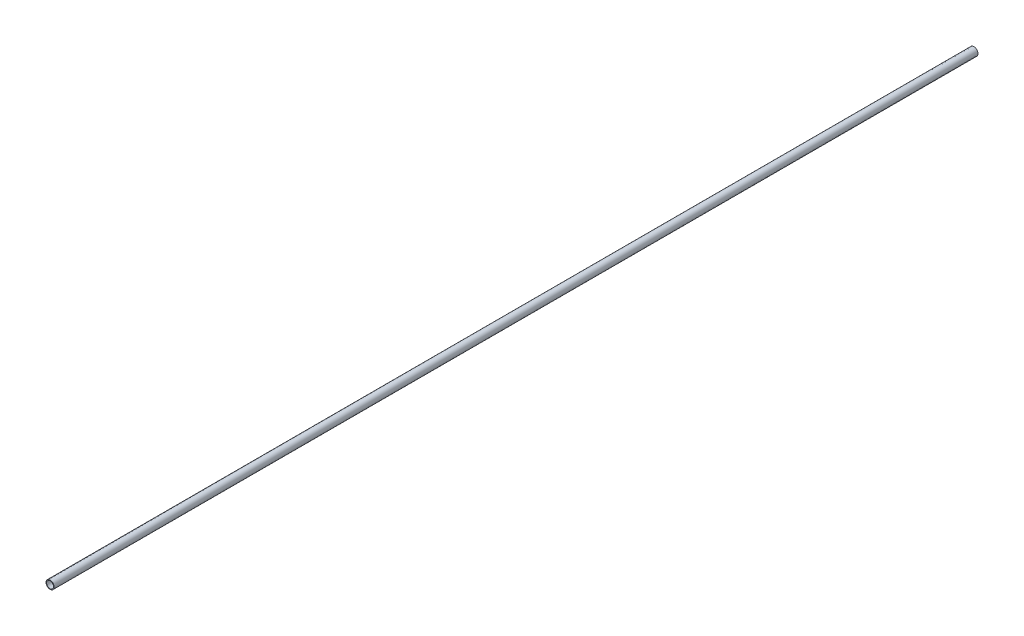
ISO-10303-21;
HEADER;
FILE_DESCRIPTION(('STEP AP214'),'2;1');
FILE_NAME('part.step','',(''),(''),'','','');
FILE_SCHEMA(('AUTOMOTIVE_DESIGN { 1 0 10303 214 1 1 1 1 }'));
ENDSEC;
DATA;
#1=APPLICATION_CONTEXT('core data for automotive mechanical design processes');
#2=APPLICATION_PROTOCOL_DEFINITION('international standard','automotive_design',2000,#1);
#3=PRODUCT_CONTEXT('',#1,'mechanical');
#4=PRODUCT('Part','Part','',(#3));
#5=PRODUCT_RELATED_PRODUCT_CATEGORY('part','',(#4));
#6=PRODUCT_DEFINITION_FORMATION('','',#4);
#7=PRODUCT_DEFINITION_CONTEXT('part definition',#1,'design');
#8=PRODUCT_DEFINITION('design','',#6,#7);
#9=PRODUCT_DEFINITION_SHAPE('','',#8);
#10=(LENGTH_UNIT() NAMED_UNIT(*) SI_UNIT(.MILLI.,.METRE.));
#11=(NAMED_UNIT(*) PLANE_ANGLE_UNIT() SI_UNIT($,.RADIAN.));
#12=(NAMED_UNIT(*) SI_UNIT($,.STERADIAN.) SOLID_ANGLE_UNIT());
#13=UNCERTAINTY_MEASURE_WITH_UNIT(LENGTH_MEASURE(1.E-05),#10,'distance_accuracy_value','');
#14=(GEOMETRIC_REPRESENTATION_CONTEXT(3) GLOBAL_UNCERTAINTY_ASSIGNED_CONTEXT((#13)) GLOBAL_UNIT_ASSIGNED_CONTEXT((#10,
#11,#12)) REPRESENTATION_CONTEXT('',''));
#15=CARTESIAN_POINT('',(0.,0.,0.));
#16=DIRECTION('',(0.,0.,1.));
#17=DIRECTION('',(1.,0.,0.));
#18=AXIS2_PLACEMENT_3D('',#15,#16,#17);
#19=CARTESIAN_POINT('',(0.,0.,5486.4));
#20=DIRECTION('',(0.,0.,1.));
#21=DIRECTION('',(1.,0.,0.));
#22=AXIS2_PLACEMENT_3D('',#19,#20,#21);
#23=PLANE('',#22);
#24=CARTESIAN_POINT('',(0.,0.,5486.4));
#25=DIRECTION('',(0.,0.,1.));
#26=DIRECTION('',(1.,0.,0.));
#27=AXIS2_PLACEMENT_3D('',#24,#25,#26);
#28=CIRCLE('',#27,24.13);
#29=CARTESIAN_POINT('',(24.13,0.,5486.4));
#30=VERTEX_POINT('',#29);
#31=EDGE_CURVE('E10',#30,#30,#28,.T.);
#32=ORIENTED_EDGE('',*,*,#31,.T.);
#33=EDGE_LOOP('',(#32));
#34=FACE_BOUND('',#33,.T.);
#35=CARTESIAN_POINT('',(0.,0.,5486.4));
#36=DIRECTION('',(0.,0.,1.));
#37=DIRECTION('',(1.,0.,0.));
#38=AXIS2_PLACEMENT_3D('',#35,#36,#37);
#39=CIRCLE('',#38,20.447);
#40=CARTESIAN_POINT('',(20.447,0.,5486.4));
#41=VERTEX_POINT('',#40);
#42=EDGE_CURVE('E39',#41,#41,#39,.T.);
#43=ORIENTED_EDGE('',*,*,#42,.F.);
#44=EDGE_LOOP('',(#43));
#45=FACE_BOUND('',#44,.T.);
#46=ADVANCED_FACE('F28',(#34,#45),#23,.T.);
#47=CARTESIAN_POINT('',(0.,0.,0.));
#48=DIRECTION('',(0.,0.,1.));
#49=DIRECTION('',(1.,0.,0.));
#50=AXIS2_PLACEMENT_3D('',#47,#48,#49);
#51=PLANE('',#50);
#52=CARTESIAN_POINT('',(0.,0.,0.));
#53=DIRECTION('',(0.,0.,1.));
#54=DIRECTION('',(1.,0.,0.));
#55=AXIS2_PLACEMENT_3D('',#52,#53,#54);
#56=CIRCLE('',#55,24.13);
#57=CARTESIAN_POINT('',(24.13,0.,0.));
#58=VERTEX_POINT('',#57);
#59=EDGE_CURVE('E32',#58,#58,#56,.T.);
#60=ORIENTED_EDGE('',*,*,#59,.F.);
#61=EDGE_LOOP('',(#60));
#62=FACE_BOUND('',#61,.T.);
#63=CARTESIAN_POINT('',(0.,0.,0.));
#64=DIRECTION('',(0.,0.,1.));
#65=DIRECTION('',(1.,0.,0.));
#66=AXIS2_PLACEMENT_3D('',#63,#64,#65);
#67=CIRCLE('',#66,20.447);
#68=CARTESIAN_POINT('',(20.447,0.,0.));
#69=VERTEX_POINT('',#68);
#70=EDGE_CURVE('E41',#69,#69,#67,.T.);
#71=ORIENTED_EDGE('',*,*,#70,.T.);
#72=EDGE_LOOP('',(#71));
#73=FACE_BOUND('',#72,.T.);
#74=ADVANCED_FACE('F51',(#62,#73),#51,.F.);
#75=CARTESIAN_POINT('',(0.,0.,5486.4));
#76=DIRECTION('',(0.,0.,-1.));
#77=DIRECTION('',(-1.,0.,0.));
#78=AXIS2_PLACEMENT_3D('',#75,#76,#77);
#79=CYLINDRICAL_SURFACE('',#78,24.13);
#80=ORIENTED_EDGE('',*,*,#31,.F.);
#81=EDGE_LOOP('',(#80));
#82=FACE_BOUND('',#81,.T.);
#83=ORIENTED_EDGE('',*,*,#59,.T.);
#84=EDGE_LOOP('',(#83));
#85=FACE_BOUND('',#84,.T.);
#86=ADVANCED_FACE('F30',(#82,#85),#79,.T.);
#87=CARTESIAN_POINT('',(0.,0.,5486.4));
#88=DIRECTION('',(0.,0.,-1.));
#89=DIRECTION('',(-1.,0.,0.));
#90=AXIS2_PLACEMENT_3D('',#87,#88,#89);
#91=CYLINDRICAL_SURFACE('',#90,20.447);
#92=ORIENTED_EDGE('',*,*,#42,.T.);
#93=EDGE_LOOP('',(#92));
#94=FACE_BOUND('',#93,.T.);
#95=ORIENTED_EDGE('',*,*,#70,.F.);
#96=EDGE_LOOP('',(#95));
#97=FACE_BOUND('',#96,.T.);
#98=ADVANCED_FACE('F47',(#94,#97),#91,.F.);
#99=CLOSED_SHELL('',(#46,#74,#86,#98));
#100=MANIFOLD_SOLID_BREP('B2',#99);
#101=ADVANCED_BREP_SHAPE_REPRESENTATION('',(#18,#100),#14);
#102=SHAPE_DEFINITION_REPRESENTATION(#9,#101);
ENDSEC;
END-ISO-10303-21;
